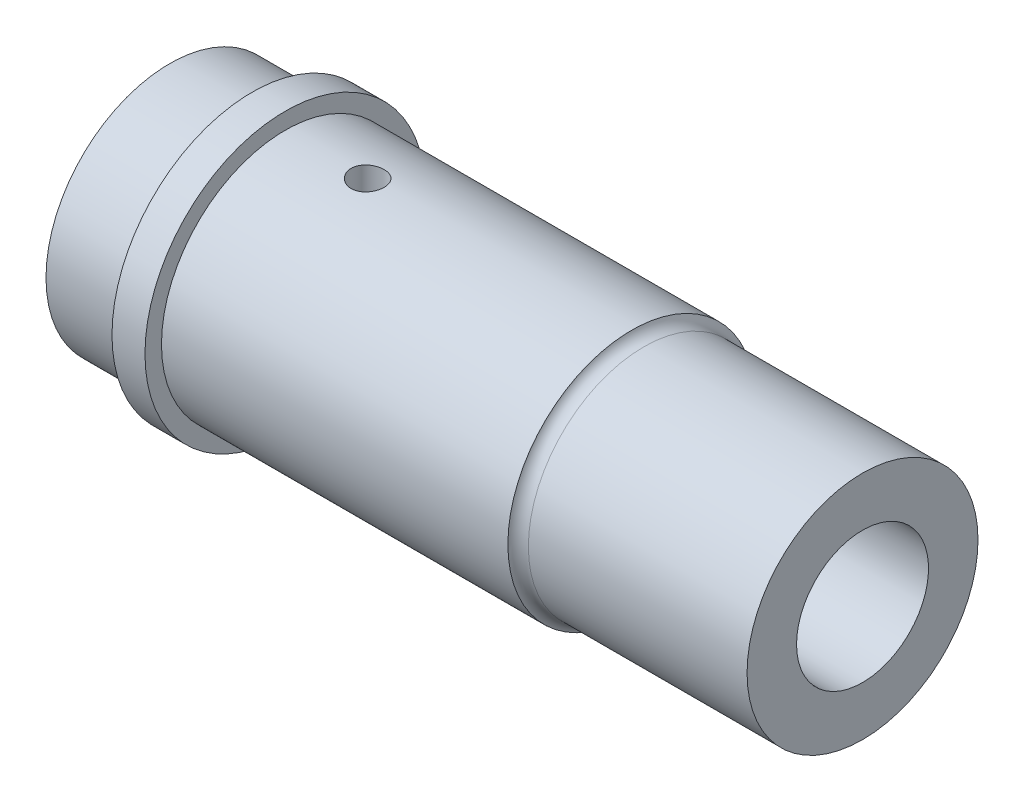
ISO-10303-21;
HEADER;
FILE_DESCRIPTION(('STEP AP214'),'2;1');
FILE_NAME('part.step','',(''),(''),'','','');
FILE_SCHEMA(('AUTOMOTIVE_DESIGN { 1 0 10303 214 1 1 1 1 }'));
ENDSEC;
DATA;
#1=APPLICATION_CONTEXT('core data for automotive mechanical design processes');
#2=APPLICATION_PROTOCOL_DEFINITION('international standard','automotive_design',2000,#1);
#3=PRODUCT_CONTEXT('',#1,'mechanical');
#4=PRODUCT('Part','Part','',(#3));
#5=PRODUCT_RELATED_PRODUCT_CATEGORY('part','',(#4));
#6=PRODUCT_DEFINITION_FORMATION('','',#4);
#7=PRODUCT_DEFINITION_CONTEXT('part definition',#1,'design');
#8=PRODUCT_DEFINITION('design','',#6,#7);
#9=PRODUCT_DEFINITION_SHAPE('','',#8);
#10=(LENGTH_UNIT() NAMED_UNIT(*) SI_UNIT(.MILLI.,.METRE.));
#11=(NAMED_UNIT(*) PLANE_ANGLE_UNIT() SI_UNIT($,.RADIAN.));
#12=(NAMED_UNIT(*) SI_UNIT($,.STERADIAN.) SOLID_ANGLE_UNIT());
#13=UNCERTAINTY_MEASURE_WITH_UNIT(LENGTH_MEASURE(1.E-05),#10,'distance_accuracy_value','');
#14=(GEOMETRIC_REPRESENTATION_CONTEXT(3) GLOBAL_UNCERTAINTY_ASSIGNED_CONTEXT((#13)) GLOBAL_UNIT_ASSIGNED_CONTEXT((#10,
#11,#12)) REPRESENTATION_CONTEXT('',''));
#15=CARTESIAN_POINT('',(0.,0.,0.));
#16=DIRECTION('',(0.,0.,1.));
#17=DIRECTION('',(1.,0.,0.));
#18=AXIS2_PLACEMENT_3D('',#15,#16,#17);
#19=CARTESIAN_POINT('',(42.,0.,0.));
#20=DIRECTION('',(-1.,0.,0.));
#21=DIRECTION('',(0.,0.,1.));
#22=AXIS2_PLACEMENT_3D('',#19,#20,#21);
#23=CYLINDRICAL_SURFACE('',#22,7.5);
#24=CARTESIAN_POINT('',(28.,0.,0.));
#25=DIRECTION('',(1.,0.,0.));
#26=DIRECTION('',(0.,0.,-1.));
#27=AXIS2_PLACEMENT_3D('',#24,#25,#26);
#28=CIRCLE('',#27,7.5);
#29=CARTESIAN_POINT('',(28.,0.,-7.5));
#30=VERTEX_POINT('',#29);
#31=EDGE_CURVE('E177',#30,#30,#28,.T.);
#32=ORIENTED_EDGE('',*,*,#31,.F.);
#33=EDGE_LOOP('',(#32));
#34=FACE_BOUND('',#33,.T.);
#35=CARTESIAN_POINT('',(12.,7.43303437365925,1.));
#36=CARTESIAN_POINT('',(12.0559019277301,7.43303522266631,0.99999764297421));
#37=CARTESIAN_POINT('',(12.1118380165464,7.43367182371829,0.995296633522847));
#38=CARTESIAN_POINT('',(12.222151231157,7.43614824351763,0.976618981332773));
#39=CARTESIAN_POINT('',(12.2765267024564,7.43798929330704,0.962632848245785));
#40=CARTESIAN_POINT('',(12.382105684117,7.44266246058434,0.925806555700512));
#41=CARTESIAN_POINT('',(12.4333114058099,7.4454938777722,0.902972651375005));
#42=CARTESIAN_POINT('',(12.5311555378537,7.45182791129731,0.849112824403647));
#43=CARTESIAN_POINT('',(12.5777946794687,7.45533041990363,0.818088216317403));
#44=CARTESIAN_POINT('',(12.6654867273345,7.46263688659337,0.74851685244753));
#45=CARTESIAN_POINT('',(12.7065064328398,7.4664424424659,0.709928411374281));
#46=CARTESIAN_POINT('',(12.7815081227281,7.47391188129393,0.626414614363067));
#47=CARTESIAN_POINT('',(12.8154897457381,7.47757575696696,0.581488933235995));
#48=CARTESIAN_POINT('',(12.8755709208582,7.48436549880109,0.486365862463802));
#49=CARTESIAN_POINT('',(12.9016402446451,7.48748928251119,0.43614921885561));
#50=CARTESIAN_POINT('',(12.9449630820904,7.49282926707925,0.332001908018684));
#51=CARTESIAN_POINT('',(12.9622169661888,7.49504550607303,0.2780713969612));
#52=CARTESIAN_POINT('',(12.9873194547901,7.49830943097799,0.168367687507043));
#53=CARTESIAN_POINT('',(12.995223407506,7.49936399102537,0.112607361734948));
#54=CARTESIAN_POINT('',(13.0015733043684,7.5002092398576,0.000542501151827599));
#55=CARTESIAN_POINT('',(13.0000196688683,7.49999998481415,-0.0557620093612336));
#56=CARTESIAN_POINT('',(12.9875426347295,7.49834672058453,-0.166940062232885));
#57=CARTESIAN_POINT('',(12.9766787676272,7.49691055668904,-0.221820418680892));
#58=CARTESIAN_POINT('',(12.9459828364892,7.49297362046144,-0.328972061356277));
#59=CARTESIAN_POINT('',(12.9261505824159,7.49047282557017,-0.38124329227092));
#60=CARTESIAN_POINT('',(12.8780182794391,7.48467409502082,-0.481875904212065));
#61=CARTESIAN_POINT('',(12.8496926884085,7.48137376072939,-0.53022492467663));
#62=CARTESIAN_POINT('',(12.7853963713586,7.4743447520952,-0.621505845367393));
#63=CARTESIAN_POINT('',(12.7494252466861,7.47061605542144,-0.664437462933408));
#64=CARTESIAN_POINT('',(12.6705260758205,7.46311294047831,-0.744015030772694));
#65=CARTESIAN_POINT('',(12.6275461159032,7.459338392122,-0.780609516765106));
#66=CARTESIAN_POINT('',(12.5360270343137,7.45219749384619,-0.846073465285956));
#67=CARTESIAN_POINT('',(12.4874878905985,7.44883114554537,-0.874942897181765));
#68=CARTESIAN_POINT('',(12.3861799998266,7.4428878816717,-0.9241414304325));
#69=CARTESIAN_POINT('',(12.3334090477408,7.44031138107393,-0.944466044533533));
#70=CARTESIAN_POINT('',(12.2251609896808,7.43624737732859,-0.97595045022462));
#71=CARTESIAN_POINT('',(12.1696840329867,7.43475981418081,-0.987110746770717));
#72=CARTESIAN_POINT('',(12.0580543324975,7.43305322505173,-0.999880803843635));
#73=CARTESIAN_POINT('',(12.0019100348337,7.43282455755814,-1.00156315549406));
#74=CARTESIAN_POINT('',(11.8901403719476,7.43363612148349,-0.995521440943979));
#75=CARTESIAN_POINT('',(11.8345149941303,7.43467632202375,-0.987797603648882));
#76=CARTESIAN_POINT('',(11.7255820067972,7.43789960218385,-0.963224025185097));
#77=CARTESIAN_POINT('',(11.6722662534909,7.44007823893825,-0.946409751616798));
#78=CARTESIAN_POINT('',(11.5692105432738,7.44532929507204,-0.904169225400625));
#79=CARTESIAN_POINT('',(11.5194707283381,7.44840174991421,-0.878742631046914));
#80=CARTESIAN_POINT('',(11.4246513447796,7.45511723309759,-0.819822032086053));
#81=CARTESIAN_POINT('',(11.3796014758159,7.45876356894567,-0.7862806158315));
#82=CARTESIAN_POINT('',(11.2957445307815,7.46620571758255,-0.712149161563993));
#83=CARTESIAN_POINT('',(11.256937731926,7.47000153699967,-0.671558810718769));
#84=CARTESIAN_POINT('',(11.1864117230394,7.47734474327666,-0.584163774179119));
#85=CARTESIAN_POINT('',(11.1547403418142,7.48089035024858,-0.537320320466262));
#86=CARTESIAN_POINT('',(11.0997158589123,7.48730670739152,-0.43893622615881));
#87=CARTESIAN_POINT('',(11.0763625701219,7.49017747274246,-0.38739569125685));
#88=CARTESIAN_POINT('',(11.0387153692059,7.49491282345577,-0.281236386261717));
#89=CARTESIAN_POINT('',(11.0243942854582,7.49678042410392,-0.226627392123681));
#90=CARTESIAN_POINT('',(11.0051297572695,7.49931158343309,-0.115753246711599));
#91=CARTESIAN_POINT('',(11.0001858286461,7.49997520428063,-0.0594881810999117));
#92=CARTESIAN_POINT('',(10.9998258663798,7.50002323624209,0.0526349368557948));
#93=CARTESIAN_POINT('',(11.0043362647028,7.49941752456714,0.108492762960941));
#94=CARTESIAN_POINT('',(11.022600520616,7.4970146660993,0.218648721526177));
#95=CARTESIAN_POINT('',(11.0363543652607,7.49521752097504,0.272946856170524));
#96=CARTESIAN_POINT('',(11.0726910235383,7.49063278321235,0.37842911729443));
#97=CARTESIAN_POINT('',(11.095269813204,7.48784564204157,0.429614650771956));
#98=CARTESIAN_POINT('',(11.1486077748229,7.48158874697992,0.527482039315438));
#99=CARTESIAN_POINT('',(11.1793670978262,7.47811898048495,0.574163811199582));
#100=CARTESIAN_POINT('',(11.2484633410018,7.47085145604927,0.662073643033369));
#101=CARTESIAN_POINT('',(11.2868548950696,7.46705145149955,0.703258578582));
#102=CARTESIAN_POINT('',(11.3700115345237,7.45956932448384,0.778629477936081));
#103=CARTESIAN_POINT('',(11.4147781219606,7.45588723005032,0.812813787651156));
#104=CARTESIAN_POINT('',(11.5096419707854,7.4490405494253,0.873343954892478));
#105=CARTESIAN_POINT('',(11.559761795755,7.44587830880396,0.89965470214564));
#106=CARTESIAN_POINT('',(11.6637242337586,7.4404568329187,0.943447591407442));
#107=CARTESIAN_POINT('',(11.7175627848798,7.43819663011144,0.960939198331794));
#108=CARTESIAN_POINT('',(11.8097241393627,7.43537566912471,0.982477401892938));
#109=CARTESIAN_POINT('',(11.8474691364837,7.4345021431111,0.989038740679089));
#110=CARTESIAN_POINT('',(11.9234707547356,7.43333120737231,0.997800826715829));
#111=CARTESIAN_POINT('',(11.9617273711999,7.43303379239608,1.00000161371131));
#112=CARTESIAN_POINT('',(12.,7.43303437365925,1.));
#113=B_SPLINE_CURVE_WITH_KNOTS('',3,(#35,#36,#37,#38,#39,#40,#41,#42,#43,#44,#45,#46,#47,#48,
#49,#50,#51,#52,#53,#54,#55,#56,#57,#58,#59,#60,#61,#62,#63,#64,#65,#66,#67,#68,#69,#70,#71,#72,
#73,#74,#75,#76,#77,#78,#79,#80,#81,#82,#83,#84,#85,#86,#87,#88,#89,#90,#91,#92,#93,#94,#95,#96,
#97,#98,#99,#100,#101,#102,#103,#104,#105,#106,#107,#108,#109,#110,#111,#112),.UNSPECIFIED.,.T.,
.F.,(4,2,2,2,2,2,2,2,2,2,2,2,2,2,2,2,2,2,2,2,2,2,2,2,2,2,2,2,2,2,2,2,2,2,2,2,2,2,4),(0.,
0.16756594461955,0.335303423041822,0.502922531373104,0.67051475416376,0.839057975594805,
1.00760984880017,1.17679778261471,1.34597860627362,1.51415284761382,1.68231961431326,
1.84941904333874,2.01652201332237,2.18413264227024,2.35175201291212,2.52067457533377,
2.68959780758443,2.85860963826768,3.02761215573449,3.19531851289863,3.36302078890669,
3.53007342408195,3.69713268808003,3.86519264070064,4.03326005374208,4.2024225588115,
4.37158125836474,4.54022861884065,4.70886727109971,4.87619854927048,5.04352959309218,
5.21078442673995,5.37804234889437,5.54654371183369,5.71508484203598,5.88436670989948,
6.05346651155517,6.16818970471025,6.28291185219902),.UNSPECIFIED.);
#114=CARTESIAN_POINT('',(12.,7.43303437365925,1.));
#115=VERTEX_POINT('',#114);
#116=EDGE_CURVE('E181',#115,#115,#113,.T.);
#117=ORIENTED_EDGE('',*,*,#116,.F.);
#118=EDGE_LOOP('',(#117));
#119=FACE_BOUND('',#118,.T.);
#120=CARTESIAN_POINT('',(7.,0.,0.));
#121=DIRECTION('',(1.,0.,0.));
#122=DIRECTION('',(0.,0.,-1.));
#123=AXIS2_PLACEMENT_3D('',#120,#121,#122);
#124=CIRCLE('',#123,7.5);
#125=CARTESIAN_POINT('',(7.,0.,-7.5));
#126=VERTEX_POINT('',#125);
#127=EDGE_CURVE('E242',#126,#126,#124,.T.);
#128=ORIENTED_EDGE('',*,*,#127,.T.);
#129=EDGE_LOOP('',(#128));
#130=FACE_BOUND('',#129,.T.);
#131=CARTESIAN_POINT('',(27.,0.,0.));
#132=DIRECTION('',(-1.,0.,0.));
#133=DIRECTION('',(0.,0.,1.));
#134=AXIS2_PLACEMENT_3D('',#131,#132,#133);
#135=CIRCLE('',#134,7.5);
#136=CARTESIAN_POINT('',(27.,-7.07106781186548,-2.5));
#137=VERTEX_POINT('',#136);
#138=CARTESIAN_POINT('',(27.,-7.07106781186547,2.5));
#139=VERTEX_POINT('',#138);
#140=EDGE_CURVE('E13',#137,#139,#135,.T.);
#141=ORIENTED_EDGE('',*,*,#140,.F.);
#142=DIRECTION('',(-1.,0.,0.));
#143=VECTOR('',#142,1.);
#144=CARTESIAN_POINT('',(42.,-7.07106781186548,-2.5));
#145=LINE('',#144,#143);
#146=CARTESIAN_POINT('',(8.5,-7.07106781186548,-2.5));
#147=VERTEX_POINT('',#146);
#148=EDGE_CURVE('E52',#137,#147,#145,.T.);
#149=ORIENTED_EDGE('',*,*,#148,.T.);
#150=CARTESIAN_POINT('',(8.5,0.,0.));
#151=DIRECTION('',(1.,0.,0.));
#152=DIRECTION('',(0.,0.,-1.));
#153=AXIS2_PLACEMENT_3D('',#150,#151,#152);
#154=CIRCLE('',#153,7.5);
#155=CARTESIAN_POINT('',(8.5,-7.07106781186547,2.5));
#156=VERTEX_POINT('',#155);
#157=EDGE_CURVE('E268',#156,#147,#154,.T.);
#158=ORIENTED_EDGE('',*,*,#157,.F.);
#159=DIRECTION('',(-1.,0.,0.));
#160=VECTOR('',#159,1.);
#161=CARTESIAN_POINT('',(42.,-7.07106781186547,2.5));
#162=LINE('',#161,#160);
#163=EDGE_CURVE('E270',#156,#139,#162,.F.);
#164=ORIENTED_EDGE('',*,*,#163,.T.);
#165=EDGE_LOOP('',(#141,#149,#158,#164));
#166=FACE_BOUND('',#165,.T.);
#167=ADVANCED_FACE('F43',(#34,#119,#130,#166),#23,.T.);
#168=CARTESIAN_POINT('',(42.,0.,0.));
#169=DIRECTION('',(1.,0.,0.));
#170=DIRECTION('',(0.,0.,-1.));
#171=AXIS2_PLACEMENT_3D('',#168,#169,#170);
#172=PLANE('',#171);
#173=CARTESIAN_POINT('',(42.,0.,0.));
#174=DIRECTION('',(-1.,0.,0.));
#175=DIRECTION('',(0.,0.,1.));
#176=AXIS2_PLACEMENT_3D('',#173,#174,#175);
#177=CIRCLE('',#176,4.);
#178=CARTESIAN_POINT('',(42.,0.,4.));
#179=VERTEX_POINT('',#178);
#180=EDGE_CURVE('E191',#179,#179,#177,.T.);
#181=ORIENTED_EDGE('',*,*,#180,.T.);
#182=EDGE_LOOP('',(#181));
#183=FACE_BOUND('',#182,.T.);
#184=CARTESIAN_POINT('',(42.,0.,0.));
#185=DIRECTION('',(1.,0.,0.));
#186=DIRECTION('',(0.,0.,-1.));
#187=AXIS2_PLACEMENT_3D('',#184,#185,#186);
#188=CIRCLE('',#187,7.);
#189=CARTESIAN_POINT('',(42.,0.,-7.));
#190=VERTEX_POINT('',#189);
#191=EDGE_CURVE('E173',#190,#190,#188,.T.);
#192=ORIENTED_EDGE('',*,*,#191,.T.);
#193=EDGE_LOOP('',(#192));
#194=FACE_BOUND('',#193,.T.);
#195=ADVANCED_FACE('F203',(#183,#194),#172,.T.);
#196=CARTESIAN_POINT('',(5.,0.,0.));
#197=DIRECTION('',(-1.,0.,0.));
#198=DIRECTION('',(0.,0.,1.));
#199=AXIS2_PLACEMENT_3D('',#196,#197,#198);
#200=CYLINDRICAL_SURFACE('',#199,7.5);
#201=CARTESIAN_POINT('',(5.,0.,0.));
#202=DIRECTION('',(1.,0.,0.));
#203=DIRECTION('',(0.,0.,-1.));
#204=AXIS2_PLACEMENT_3D('',#201,#202,#203);
#205=CIRCLE('',#204,7.5);
#206=CARTESIAN_POINT('',(5.,0.,-7.5));
#207=VERTEX_POINT('',#206);
#208=EDGE_CURVE('E232',#207,#207,#205,.T.);
#209=ORIENTED_EDGE('',*,*,#208,.F.);
#210=EDGE_LOOP('',(#209));
#211=FACE_BOUND('',#210,.T.);
#212=CARTESIAN_POINT('',(0.,0.,0.));
#213=DIRECTION('',(1.,0.,0.));
#214=DIRECTION('',(0.,0.,-1.));
#215=AXIS2_PLACEMENT_3D('',#212,#213,#214);
#216=CIRCLE('',#215,7.5);
#217=CARTESIAN_POINT('',(0.,0.,-7.5));
#218=VERTEX_POINT('',#217);
#219=EDGE_CURVE('E235',#218,#218,#216,.T.);
#220=ORIENTED_EDGE('',*,*,#219,.T.);
#221=EDGE_LOOP('',(#220));
#222=FACE_BOUND('',#221,.T.);
#223=ADVANCED_FACE('F206',(#211,#222),#200,.T.);
#224=CARTESIAN_POINT('',(0.,0.,0.));
#225=DIRECTION('',(1.,0.,0.));
#226=DIRECTION('',(0.,0.,-1.));
#227=AXIS2_PLACEMENT_3D('',#224,#225,#226);
#228=PLANE('',#227);
#229=DIRECTION('',(0.,0.,-1.));
#230=VECTOR('',#229,1.);
#231=CARTESIAN_POINT('',(0.,5.5,-1.5));
#232=LINE('',#231,#230);
#233=CARTESIAN_POINT('',(0.,5.5,1.5));
#234=VERTEX_POINT('',#233);
#235=CARTESIAN_POINT('',(0.,5.5,-1.5));
#236=VERTEX_POINT('',#235);
#237=EDGE_CURVE('E160',#234,#236,#232,.T.);
#238=ORIENTED_EDGE('',*,*,#237,.F.);
#239=DIRECTION('',(0.,1.,0.));
#240=VECTOR('',#239,1.);
#241=CARTESIAN_POINT('',(0.,2.5,1.5));
#242=LINE('',#241,#240);
#243=CARTESIAN_POINT('',(0.,3.70809924354783,1.5));
#244=VERTEX_POINT('',#243);
#245=EDGE_CURVE('E146',#244,#234,#242,.T.);
#246=ORIENTED_EDGE('',*,*,#245,.F.);
#247=CARTESIAN_POINT('',(0.,0.,0.));
#248=DIRECTION('',(-1.,0.,0.));
#249=DIRECTION('',(0.,0.,1.));
#250=AXIS2_PLACEMENT_3D('',#247,#248,#249);
#251=CIRCLE('',#250,4.);
#252=CARTESIAN_POINT('',(0.,3.70809924354783,-1.5));
#253=VERTEX_POINT('',#252);
#254=EDGE_CURVE('E190',#253,#244,#251,.T.);
#255=ORIENTED_EDGE('',*,*,#254,.F.);
#256=DIRECTION('',(0.,-1.,0.));
#257=VECTOR('',#256,1.);
#258=CARTESIAN_POINT('',(0.,2.5,-1.5));
#259=LINE('',#258,#257);
#260=EDGE_CURVE('E152',#236,#253,#259,.T.);
#261=ORIENTED_EDGE('',*,*,#260,.F.);
#262=EDGE_LOOP('',(#238,#246,#255,#261));
#263=FACE_BOUND('',#262,.T.);
#264=ORIENTED_EDGE('',*,*,#219,.F.);
#265=EDGE_LOOP('',(#264));
#266=FACE_BOUND('',#265,.T.);
#267=ADVANCED_FACE('F221',(#263,#266),#228,.F.);
#268=CARTESIAN_POINT('',(7.,0.,0.));
#269=DIRECTION('',(-1.,0.,0.));
#270=DIRECTION('',(0.,0.,1.));
#271=AXIS2_PLACEMENT_3D('',#268,#269,#270);
#272=CYLINDRICAL_SURFACE('',#271,8.5);
#273=CARTESIAN_POINT('',(7.,0.,0.));
#274=DIRECTION('',(1.,0.,0.));
#275=DIRECTION('',(0.,0.,-1.));
#276=AXIS2_PLACEMENT_3D('',#273,#274,#275);
#277=CIRCLE('',#276,8.5);
#278=CARTESIAN_POINT('',(7.,0.,-8.5));
#279=VERTEX_POINT('',#278);
#280=EDGE_CURVE('E238',#279,#279,#277,.T.);
#281=ORIENTED_EDGE('',*,*,#280,.F.);
#282=EDGE_LOOP('',(#281));
#283=FACE_BOUND('',#282,.T.);
#284=CARTESIAN_POINT('',(5.,0.,0.));
#285=DIRECTION('',(1.,0.,0.));
#286=DIRECTION('',(0.,0.,-1.));
#287=AXIS2_PLACEMENT_3D('',#284,#285,#286);
#288=CIRCLE('',#287,8.5);
#289=CARTESIAN_POINT('',(5.,0.,-8.5));
#290=VERTEX_POINT('',#289);
#291=EDGE_CURVE('E246',#290,#290,#288,.T.);
#292=ORIENTED_EDGE('',*,*,#291,.T.);
#293=EDGE_LOOP('',(#292));
#294=FACE_BOUND('',#293,.T.);
#295=ADVANCED_FACE('F214',(#283,#294),#272,.T.);
#296=CARTESIAN_POINT('',(7.,0.,0.));
#297=DIRECTION('',(1.,0.,0.));
#298=DIRECTION('',(0.,0.,-1.));
#299=AXIS2_PLACEMENT_3D('',#296,#297,#298);
#300=PLANE('',#299);
#301=ORIENTED_EDGE('',*,*,#127,.F.);
#302=EDGE_LOOP('',(#301));
#303=FACE_BOUND('',#302,.T.);
#304=ORIENTED_EDGE('',*,*,#280,.T.);
#305=EDGE_LOOP('',(#304));
#306=FACE_BOUND('',#305,.T.);
#307=ADVANCED_FACE('F211',(#303,#306),#300,.T.);
#308=CARTESIAN_POINT('',(5.,0.,0.));
#309=DIRECTION('',(1.,0.,0.));
#310=DIRECTION('',(0.,0.,-1.));
#311=AXIS2_PLACEMENT_3D('',#308,#309,#310);
#312=PLANE('',#311);
#313=ORIENTED_EDGE('',*,*,#208,.T.);
#314=EDGE_LOOP('',(#313));
#315=FACE_BOUND('',#314,.T.);
#316=ORIENTED_EDGE('',*,*,#291,.F.);
#317=EDGE_LOOP('',(#316));
#318=FACE_BOUND('',#317,.T.);
#319=ADVANCED_FACE('F201',(#315,#318),#312,.F.);
#320=CARTESIAN_POINT('',(42.,0.,0.));
#321=DIRECTION('',(-1.,0.,0.));
#322=DIRECTION('',(0.,0.,1.));
#323=AXIS2_PLACEMENT_3D('',#320,#321,#322);
#324=CYLINDRICAL_SURFACE('',#323,4.);
#325=ORIENTED_EDGE('',*,*,#254,.T.);
#326=DIRECTION('',(-1.,0.,0.));
#327=VECTOR('',#326,1.);
#328=CARTESIAN_POINT('',(42.,3.70809924354783,1.5));
#329=LINE('',#328,#327);
#330=CARTESIAN_POINT('',(28.,3.70809924354783,1.5));
#331=VERTEX_POINT('',#330);
#332=EDGE_CURVE('E264',#244,#331,#329,.F.);
#333=ORIENTED_EDGE('',*,*,#332,.T.);
#334=CARTESIAN_POINT('',(28.,0.,0.));
#335=DIRECTION('',(1.,0.,0.));
#336=DIRECTION('',(0.,0.,-1.));
#337=AXIS2_PLACEMENT_3D('',#334,#335,#336);
#338=CIRCLE('',#337,4.);
#339=CARTESIAN_POINT('',(28.,3.70809924354783,-1.5));
#340=VERTEX_POINT('',#339);
#341=EDGE_CURVE('E254',#331,#340,#338,.F.);
#342=ORIENTED_EDGE('',*,*,#341,.T.);
#343=DIRECTION('',(-1.,0.,0.));
#344=VECTOR('',#343,1.);
#345=CARTESIAN_POINT('',(42.,3.70809924354783,-1.5));
#346=LINE('',#345,#344);
#347=EDGE_CURVE('E260',#340,#253,#346,.T.);
#348=ORIENTED_EDGE('',*,*,#347,.T.);
#349=EDGE_LOOP('',(#325,#333,#342,#348));
#350=FACE_BOUND('',#349,.T.);
#351=ORIENTED_EDGE('',*,*,#180,.F.);
#352=EDGE_LOOP('',(#351));
#353=FACE_BOUND('',#352,.T.);
#354=ADVANCED_FACE('F198',(#350,#353),#324,.F.);
#355=CARTESIAN_POINT('',(12.,-8.501,0.));
#356=DIRECTION('',(0.,1.,0.));
#357=DIRECTION('',(0.,0.,1.));
#358=AXIS2_PLACEMENT_3D('',#355,#356,#357);
#359=CYLINDRICAL_SURFACE('',#358,1.);
#360=CARTESIAN_POINT('',(12.,5.5,0.));
#361=DIRECTION('',(0.,1.,0.));
#362=DIRECTION('',(0.,0.,1.));
#363=AXIS2_PLACEMENT_3D('',#360,#361,#362);
#364=CIRCLE('',#363,1.);
#365=CARTESIAN_POINT('',(12.,5.5,1.));
#366=VERTEX_POINT('',#365);
#367=EDGE_CURVE('E169',#366,#366,#364,.F.);
#368=ORIENTED_EDGE('',*,*,#367,.T.);
#369=EDGE_LOOP('',(#368));
#370=FACE_BOUND('',#369,.T.);
#371=ORIENTED_EDGE('',*,*,#116,.T.);
#372=EDGE_LOOP('',(#371));
#373=FACE_BOUND('',#372,.T.);
#374=ADVANCED_FACE('F193',(#370,#373),#359,.F.);
#375=CARTESIAN_POINT('',(28.,0.,0.));
#376=DIRECTION('',(1.,0.,0.));
#377=DIRECTION('',(0.,0.,-1.));
#378=AXIS2_PLACEMENT_3D('',#375,#376,#377);
#379=CYLINDRICAL_SURFACE('',#378,7.);
#380=CARTESIAN_POINT('',(28.7416198487096,0.,0.));
#381=DIRECTION('',(-1.,0.,0.));
#382=DIRECTION('',(0.,0.,1.));
#383=AXIS2_PLACEMENT_3D('',#380,#381,#382);
#384=CIRCLE('',#383,7.);
#385=CARTESIAN_POINT('',(28.7416198487096,0.,7.));
#386=VERTEX_POINT('',#385);
#387=EDGE_CURVE('E250',#386,#386,#384,.F.);
#388=ORIENTED_EDGE('',*,*,#387,.T.);
#389=EDGE_LOOP('',(#388));
#390=FACE_BOUND('',#389,.T.);
#391=ORIENTED_EDGE('',*,*,#191,.F.);
#392=EDGE_LOOP('',(#391));
#393=FACE_BOUND('',#392,.T.);
#394=ADVANCED_FACE('F320',(#390,#393),#379,.T.);
#395=CARTESIAN_POINT('',(28.7416198487096,0.,0.));
#396=DIRECTION('',(-1.,0.,0.));
#397=DIRECTION('',(0.,0.,1.));
#398=AXIS2_PLACEMENT_3D('',#395,#396,#397);
#399=TOROIDAL_SURFACE('',#398,7.8,0.8);
#400=ORIENTED_EDGE('',*,*,#31,.T.);
#401=EDGE_LOOP('',(#400));
#402=FACE_BOUND('',#401,.T.);
#403=ORIENTED_EDGE('',*,*,#387,.F.);
#404=EDGE_LOOP('',(#403));
#405=FACE_BOUND('',#404,.T.);
#406=ADVANCED_FACE('F45',(#402,#405),#399,.F.);
#407=CARTESIAN_POINT('',(28.,2.5,1.5));
#408=DIRECTION('',(0.,0.,1.));
#409=DIRECTION('',(1.,0.,0.));
#410=AXIS2_PLACEMENT_3D('',#407,#408,#409);
#411=PLANE('',#410);
#412=ORIENTED_EDGE('',*,*,#245,.T.);
#413=DIRECTION('',(-1.,0.,0.));
#414=VECTOR('',#413,1.);
#415=CARTESIAN_POINT('',(28.,5.5,1.5));
#416=LINE('',#415,#414);
#417=CARTESIAN_POINT('',(28.,5.5,1.5));
#418=VERTEX_POINT('',#417);
#419=EDGE_CURVE('E157',#418,#234,#416,.T.);
#420=ORIENTED_EDGE('',*,*,#419,.F.);
#421=DIRECTION('',(0.,1.,0.));
#422=VECTOR('',#421,1.);
#423=CARTESIAN_POINT('',(28.,2.5,1.5));
#424=LINE('',#423,#422);
#425=EDGE_CURVE('E148',#331,#418,#424,.T.);
#426=ORIENTED_EDGE('',*,*,#425,.F.);
#427=ORIENTED_EDGE('',*,*,#332,.F.);
#428=EDGE_LOOP('',(#412,#420,#426,#427));
#429=FACE_BOUND('',#428,.T.);
#430=ADVANCED_FACE('F299',(#429),#411,.F.);
#431=CARTESIAN_POINT('',(28.,2.5,-1.5));
#432=DIRECTION('',(0.,0.,-1.));
#433=DIRECTION('',(-1.,0.,0.));
#434=AXIS2_PLACEMENT_3D('',#431,#432,#433);
#435=PLANE('',#434);
#436=DIRECTION('',(0.,-1.,0.));
#437=VECTOR('',#436,1.);
#438=CARTESIAN_POINT('',(28.,2.5,-1.5));
#439=LINE('',#438,#437);
#440=CARTESIAN_POINT('',(28.,5.5,-1.5));
#441=VERTEX_POINT('',#440);
#442=EDGE_CURVE('E67',#441,#340,#439,.T.);
#443=ORIENTED_EDGE('',*,*,#442,.F.);
#444=DIRECTION('',(-1.,0.,0.));
#445=VECTOR('',#444,1.);
#446=CARTESIAN_POINT('',(28.,5.5,-1.5));
#447=LINE('',#446,#445);
#448=EDGE_CURVE('E166',#441,#236,#447,.T.);
#449=ORIENTED_EDGE('',*,*,#448,.T.);
#450=ORIENTED_EDGE('',*,*,#260,.T.);
#451=ORIENTED_EDGE('',*,*,#347,.F.);
#452=EDGE_LOOP('',(#443,#449,#450,#451));
#453=FACE_BOUND('',#452,.T.);
#454=ADVANCED_FACE('F307',(#453),#435,.F.);
#455=CARTESIAN_POINT('',(28.,0.,0.));
#456=DIRECTION('',(1.,0.,0.));
#457=DIRECTION('',(0.,0.,-1.));
#458=AXIS2_PLACEMENT_3D('',#455,#456,#457);
#459=PLANE('',#458);
#460=ORIENTED_EDGE('',*,*,#425,.T.);
#461=DIRECTION('',(0.,0.,-1.));
#462=VECTOR('',#461,1.);
#463=CARTESIAN_POINT('',(28.,5.5,-1.5));
#464=LINE('',#463,#462);
#465=EDGE_CURVE('E151',#418,#441,#464,.T.);
#466=ORIENTED_EDGE('',*,*,#465,.T.);
#467=ORIENTED_EDGE('',*,*,#442,.T.);
#468=ORIENTED_EDGE('',*,*,#341,.F.);
#469=EDGE_LOOP('',(#460,#466,#467,#468));
#470=FACE_BOUND('',#469,.T.);
#471=ADVANCED_FACE('F305',(#470),#459,.F.);
#472=CARTESIAN_POINT('',(28.,5.5,-1.5));
#473=DIRECTION('',(0.,1.,0.));
#474=DIRECTION('',(0.,0.,1.));
#475=AXIS2_PLACEMENT_3D('',#472,#473,#474);
#476=PLANE('',#475);
#477=ORIENTED_EDGE('',*,*,#237,.T.);
#478=ORIENTED_EDGE('',*,*,#448,.F.);
#479=ORIENTED_EDGE('',*,*,#465,.F.);
#480=ORIENTED_EDGE('',*,*,#419,.T.);
#481=EDGE_LOOP('',(#477,#478,#479,#480));
#482=FACE_BOUND('',#481,.T.);
#483=ORIENTED_EDGE('',*,*,#367,.F.);
#484=EDGE_LOOP('',(#483));
#485=FACE_BOUND('',#484,.T.);
#486=ADVANCED_FACE('F303',(#482,#485),#476,.F.);
#487=CARTESIAN_POINT('',(-0.0710678118654787,-10.,-2.5));
#488=DIRECTION('',(0.,0.,-1.));
#489=DIRECTION('',(-1.,0.,0.));
#490=AXIS2_PLACEMENT_3D('',#487,#488,#489);
#491=PLANE('',#490);
#492=DIRECTION('',(0.,1.,0.));
#493=VECTOR('',#492,1.);
#494=CARTESIAN_POINT('',(27.,-10.,-2.5));
#495=LINE('',#494,#493);
#496=CARTESIAN_POINT('',(27.,-5.,-2.5));
#497=VERTEX_POINT('',#496);
#498=EDGE_CURVE('E109',#137,#497,#495,.T.);
#499=ORIENTED_EDGE('',*,*,#498,.T.);
#500=DIRECTION('',(1.,0.,0.));
#501=VECTOR('',#500,1.);
#502=CARTESIAN_POINT('',(-0.0710678118654787,-5.,-2.5));
#503=LINE('',#502,#501);
#504=CARTESIAN_POINT('',(8.5,-5.,-2.5));
#505=VERTEX_POINT('',#504);
#506=EDGE_CURVE('E113',#505,#497,#503,.T.);
#507=ORIENTED_EDGE('',*,*,#506,.F.);
#508=DIRECTION('',(0.,-1.,0.));
#509=VECTOR('',#508,1.);
#510=CARTESIAN_POINT('',(8.5,-10.,-2.5));
#511=LINE('',#510,#509);
#512=EDGE_CURVE('E147',#505,#147,#511,.T.);
#513=ORIENTED_EDGE('',*,*,#512,.T.);
#514=ORIENTED_EDGE('',*,*,#148,.F.);
#515=EDGE_LOOP('',(#499,#507,#513,#514));
#516=FACE_BOUND('',#515,.T.);
#517=ADVANCED_FACE('F111',(#516),#491,.F.);
#518=CARTESIAN_POINT('',(-0.0710678118654787,-10.,2.5));
#519=DIRECTION('',(0.,0.,1.));
#520=DIRECTION('',(1.,0.,0.));
#521=AXIS2_PLACEMENT_3D('',#518,#519,#520);
#522=PLANE('',#521);
#523=DIRECTION('',(0.,1.,0.));
#524=VECTOR('',#523,1.);
#525=CARTESIAN_POINT('',(8.5,-10.,2.5));
#526=LINE('',#525,#524);
#527=CARTESIAN_POINT('',(8.5,-5.,2.5));
#528=VERTEX_POINT('',#527);
#529=EDGE_CURVE('E59',#156,#528,#526,.T.);
#530=ORIENTED_EDGE('',*,*,#529,.T.);
#531=DIRECTION('',(1.,0.,0.));
#532=VECTOR('',#531,1.);
#533=CARTESIAN_POINT('',(-0.0710678118654787,-5.,2.5));
#534=LINE('',#533,#532);
#535=CARTESIAN_POINT('',(27.,-5.,2.5));
#536=VERTEX_POINT('',#535);
#537=EDGE_CURVE('E128',#528,#536,#534,.T.);
#538=ORIENTED_EDGE('',*,*,#537,.T.);
#539=DIRECTION('',(0.,-1.,0.));
#540=VECTOR('',#539,1.);
#541=CARTESIAN_POINT('',(27.,-10.,2.5));
#542=LINE('',#541,#540);
#543=EDGE_CURVE('E129',#536,#139,#542,.T.);
#544=ORIENTED_EDGE('',*,*,#543,.T.);
#545=ORIENTED_EDGE('',*,*,#163,.F.);
#546=EDGE_LOOP('',(#530,#538,#544,#545));
#547=FACE_BOUND('',#546,.T.);
#548=ADVANCED_FACE('F277',(#547),#522,.F.);
#549=CARTESIAN_POINT('',(27.,0.,0.));
#550=DIRECTION('',(-1.,0.,0.));
#551=DIRECTION('',(0.,0.,1.));
#552=AXIS2_PLACEMENT_3D('',#549,#550,#551);
#553=PLANE('',#552);
#554=ORIENTED_EDGE('',*,*,#140,.T.);
#555=ORIENTED_EDGE('',*,*,#543,.F.);
#556=DIRECTION('',(0.,0.,1.));
#557=VECTOR('',#556,1.);
#558=CARTESIAN_POINT('',(27.,-5.,2.5));
#559=LINE('',#558,#557);
#560=EDGE_CURVE('E119',#497,#536,#559,.T.);
#561=ORIENTED_EDGE('',*,*,#560,.F.);
#562=ORIENTED_EDGE('',*,*,#498,.F.);
#563=EDGE_LOOP('',(#554,#555,#561,#562));
#564=FACE_BOUND('',#563,.T.);
#565=ADVANCED_FACE('F132',(#564),#553,.T.);
#566=CARTESIAN_POINT('',(8.5,0.,0.));
#567=DIRECTION('',(1.,0.,0.));
#568=DIRECTION('',(0.,0.,-1.));
#569=AXIS2_PLACEMENT_3D('',#566,#567,#568);
#570=PLANE('',#569);
#571=ORIENTED_EDGE('',*,*,#157,.T.);
#572=ORIENTED_EDGE('',*,*,#512,.F.);
#573=DIRECTION('',(0.,0.,-1.));
#574=VECTOR('',#573,1.);
#575=CARTESIAN_POINT('',(8.5,-5.,2.5));
#576=LINE('',#575,#574);
#577=EDGE_CURVE('E125',#528,#505,#576,.T.);
#578=ORIENTED_EDGE('',*,*,#577,.F.);
#579=ORIENTED_EDGE('',*,*,#529,.F.);
#580=EDGE_LOOP('',(#571,#572,#578,#579));
#581=FACE_BOUND('',#580,.T.);
#582=ADVANCED_FACE('F278',(#581),#570,.T.);
#583=CARTESIAN_POINT('',(-0.0710678118654787,-5.,2.5));
#584=DIRECTION('',(0.,1.,0.));
#585=DIRECTION('',(0.,0.,1.));
#586=AXIS2_PLACEMENT_3D('',#583,#584,#585);
#587=PLANE('',#586);
#588=ORIENTED_EDGE('',*,*,#577,.T.);
#589=ORIENTED_EDGE('',*,*,#506,.T.);
#590=ORIENTED_EDGE('',*,*,#560,.T.);
#591=ORIENTED_EDGE('',*,*,#537,.F.);
#592=EDGE_LOOP('',(#588,#589,#590,#591));
#593=FACE_BOUND('',#592,.T.);
#594=ADVANCED_FACE('F123',(#593),#587,.F.);
#595=CLOSED_SHELL('',(#167,#195,#223,#267,#295,#307,#319,#354,#374,#394,#406,#430,#454,#471,
#486,#517,#548,#565,#582,#594));
#596=MANIFOLD_SOLID_BREP('B2',#595);
#597=ADVANCED_BREP_SHAPE_REPRESENTATION('',(#18,#596),#14);
#598=SHAPE_DEFINITION_REPRESENTATION(#9,#597);
ENDSEC;
END-ISO-10303-21;
